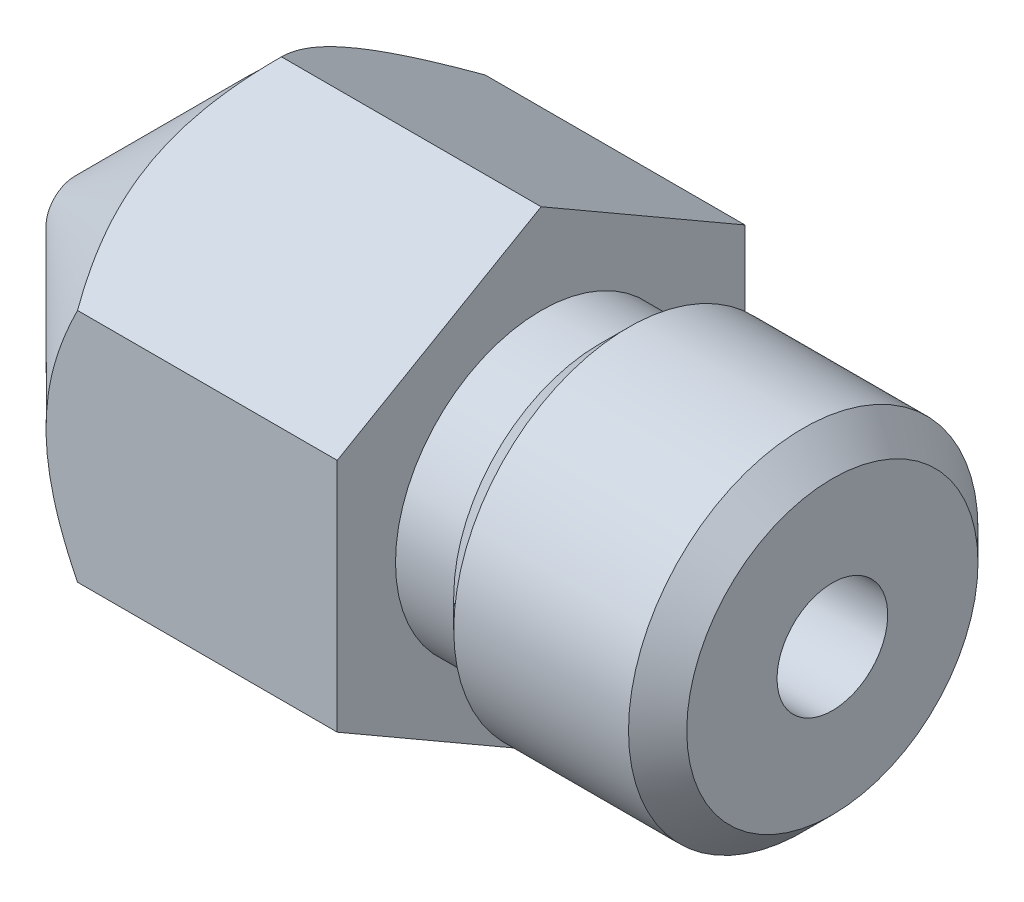
ISO-10303-21;
HEADER;
FILE_DESCRIPTION(('STEP AP214'),'2;1');
FILE_NAME('part.step','',(''),(''),'','','');
FILE_SCHEMA(('AUTOMOTIVE_DESIGN { 1 0 10303 214 1 1 1 1 }'));
ENDSEC;
DATA;
#1=APPLICATION_CONTEXT('core data for automotive mechanical design processes');
#2=APPLICATION_PROTOCOL_DEFINITION('international standard','automotive_design',2000,#1);
#3=PRODUCT_CONTEXT('',#1,'mechanical');
#4=PRODUCT('Part','Part','',(#3));
#5=PRODUCT_RELATED_PRODUCT_CATEGORY('part','',(#4));
#6=PRODUCT_DEFINITION_FORMATION('','',#4);
#7=PRODUCT_DEFINITION_CONTEXT('part definition',#1,'design');
#8=PRODUCT_DEFINITION('design','',#6,#7);
#9=PRODUCT_DEFINITION_SHAPE('','',#8);
#10=(LENGTH_UNIT() NAMED_UNIT(*) SI_UNIT(.MILLI.,.METRE.));
#11=(NAMED_UNIT(*) PLANE_ANGLE_UNIT() SI_UNIT($,.RADIAN.));
#12=(NAMED_UNIT(*) SI_UNIT($,.STERADIAN.) SOLID_ANGLE_UNIT());
#13=UNCERTAINTY_MEASURE_WITH_UNIT(LENGTH_MEASURE(1.E-05),#10,'distance_accuracy_value','');
#14=(GEOMETRIC_REPRESENTATION_CONTEXT(3) GLOBAL_UNCERTAINTY_ASSIGNED_CONTEXT((#13)) GLOBAL_UNIT_ASSIGNED_CONTEXT((#10,
#11,#12)) REPRESENTATION_CONTEXT('',''));
#15=CARTESIAN_POINT('',(0.,0.,0.));
#16=DIRECTION('',(0.,0.,1.));
#17=DIRECTION('',(1.,0.,0.));
#18=AXIS2_PLACEMENT_3D('',#15,#16,#17);
#19=CARTESIAN_POINT('',(8.,2.5,0.));
#20=DIRECTION('',(-1.,0.,0.));
#21=DIRECTION('',(0.,0.,1.));
#22=AXIS2_PLACEMENT_3D('',#19,#20,#21);
#23=PLANE('',#22);
#24=CARTESIAN_POINT('',(8.,0.,0.));
#25=DIRECTION('',(-1.,0.,0.));
#26=DIRECTION('',(0.,0.,1.));
#27=AXIS2_PLACEMENT_3D('',#24,#25,#26);
#28=CIRCLE('',#27,2.5);
#29=CARTESIAN_POINT('',(8.,0.,2.5));
#30=VERTEX_POINT('',#29);
#31=EDGE_CURVE('E154',#30,#30,#28,.T.);
#32=ORIENTED_EDGE('',*,*,#31,.T.);
#33=EDGE_LOOP('',(#32));
#34=FACE_BOUND('',#33,.T.);
#35=DIRECTION('',(0.,-1.,0.));
#36=VECTOR('',#35,1.);
#37=CARTESIAN_POINT('',(8.,2.02072594216369,3.5));
#38=LINE('',#37,#36);
#39=CARTESIAN_POINT('',(8.,2.02072594216369,3.5));
#40=VERTEX_POINT('',#39);
#41=CARTESIAN_POINT('',(8.,-2.02072594216369,3.5));
#42=VERTEX_POINT('',#41);
#43=EDGE_CURVE('E124',#40,#42,#38,.T.);
#44=ORIENTED_EDGE('',*,*,#43,.T.);
#45=DIRECTION('',(0.,-0.5,-0.866025403784439));
#46=VECTOR('',#45,1.);
#47=CARTESIAN_POINT('',(8.,-2.02072594216369,3.5));
#48=LINE('',#47,#46);
#49=CARTESIAN_POINT('',(8.,-4.04145188432738,0.));
#50=VERTEX_POINT('',#49);
#51=EDGE_CURVE('E119',#42,#50,#48,.T.);
#52=ORIENTED_EDGE('',*,*,#51,.T.);
#53=DIRECTION('',(0.,0.5,-0.866025403784439));
#54=VECTOR('',#53,1.);
#55=CARTESIAN_POINT('',(8.,-4.04145188432738,0.));
#56=LINE('',#55,#54);
#57=CARTESIAN_POINT('',(8.,-2.02072594216369,-3.5));
#58=VERTEX_POINT('',#57);
#59=EDGE_CURVE('E59',#50,#58,#56,.T.);
#60=ORIENTED_EDGE('',*,*,#59,.T.);
#61=DIRECTION('',(0.,1.,0.));
#62=VECTOR('',#61,1.);
#63=CARTESIAN_POINT('',(8.,-2.02072594216369,-3.5));
#64=LINE('',#63,#62);
#65=CARTESIAN_POINT('',(8.,2.02072594216369,-3.5));
#66=VERTEX_POINT('',#65);
#67=EDGE_CURVE('E108',#58,#66,#64,.T.);
#68=ORIENTED_EDGE('',*,*,#67,.T.);
#69=DIRECTION('',(0.,0.5,0.866025403784439));
#70=VECTOR('',#69,1.);
#71=CARTESIAN_POINT('',(8.,2.02072594216369,-3.5));
#72=LINE('',#71,#70);
#73=CARTESIAN_POINT('',(8.,4.04145188432738,0.));
#74=VERTEX_POINT('',#73);
#75=EDGE_CURVE('E115',#66,#74,#72,.T.);
#76=ORIENTED_EDGE('',*,*,#75,.T.);
#77=DIRECTION('',(0.,-0.5,0.866025403784439));
#78=VECTOR('',#77,1.);
#79=CARTESIAN_POINT('',(8.,4.04145188432738,0.));
#80=LINE('',#79,#78);
#81=EDGE_CURVE('E130',#74,#40,#80,.T.);
#82=ORIENTED_EDGE('',*,*,#81,.T.);
#83=EDGE_LOOP('',(#44,#52,#60,#68,#76,#82));
#84=FACE_BOUND('',#83,.T.);
#85=ADVANCED_FACE('F43',(#34,#84),#23,.F.);
#86=CARTESIAN_POINT('',(4.,0.,0.));
#87=DIRECTION('',(1.,0.,0.));
#88=DIRECTION('',(0.,0.,-1.));
#89=AXIS2_PLACEMENT_3D('',#86,#87,#88);
#90=CONICAL_SURFACE('',#89,4.5,0.78539816339745);
#91=CARTESIAN_POINT('',(0.,0.,0.));
#92=DIRECTION('',(-1.,0.,0.));
#93=DIRECTION('',(0.,0.,1.));
#94=AXIS2_PLACEMENT_3D('',#91,#92,#93);
#95=CIRCLE('',#94,0.499999999999984);
#96=CARTESIAN_POINT('',(0.,0.,0.499999999999984));
#97=VERTEX_POINT('',#96);
#98=EDGE_CURVE('E150',#97,#97,#95,.T.);
#99=ORIENTED_EDGE('',*,*,#98,.F.);
#100=EDGE_LOOP('',(#99));
#101=FACE_BOUND('',#100,.T.);
#102=CARTESIAN_POINT('',(5.60473460571073,-5.00177814443646,3.5));
#103=CARTESIAN_POINT('',(5.50158525305018,-4.87585100221837,3.5));
#104=CARTESIAN_POINT('',(5.39916732462682,-4.74931512243237,3.5));
#105=CARTESIAN_POINT('',(5.19618183428807,-4.49471658352455,3.5));
#106=CARTESIAN_POINT('',(5.09561475080956,-4.36665354335295,3.5));
#107=CARTESIAN_POINT('',(4.8956806099685,-4.1073404488107,3.5));
#108=CARTESIAN_POINT('',(4.79633882689846,-3.97607084326665,3.5));
#109=CARTESIAN_POINT('',(4.60061166670264,-3.71135912834578,3.5));
#110=CARTESIAN_POINT('',(4.50422600560764,-3.57791722953954,3.5));
#111=CARTESIAN_POINT('',(4.30644876507746,-3.29590423287125,3.5));
#112=CARTESIAN_POINT('',(4.20542063931455,-3.14707678989524,3.5));
#113=CARTESIAN_POINT('',(4.0092782092562,-2.84547482694549,3.5));
#114=CARTESIAN_POINT('',(3.91416582545941,-2.69269904772549,3.5));
#115=CARTESIAN_POINT('',(3.73242858701602,-2.38308612845867,3.5));
#116=CARTESIAN_POINT('',(3.64576650922454,-2.22627104221582,3.5));
#117=CARTESIAN_POINT('',(3.48347840457084,-1.90708387824138,3.5));
#118=CARTESIAN_POINT('',(3.4078428797255,-1.74471673355065,3.5));
#119=CARTESIAN_POINT('',(3.29115360790501,-1.46096984620552,3.5));
#120=CARTESIAN_POINT('',(3.24639235010286,-1.34112588832474,3.5));
#121=CARTESIAN_POINT('',(3.16645824704642,-1.09820885957048,3.5));
#122=CARTESIAN_POINT('',(3.13128671673046,-0.975135348396179,3.5));
#123=CARTESIAN_POINT('',(3.07315329237583,-0.728966718302567,3.5));
#124=CARTESIAN_POINT('',(3.04993834404319,-0.605932392197103,3.5));
#125=CARTESIAN_POINT('',(3.01613662323999,-0.358129563749721,3.5));
#126=CARTESIAN_POINT('',(3.00554687121748,-0.233361477610497,3.5));
#127=CARTESIAN_POINT('',(2.9980076393283,0.0101654253989616,3.5));
#128=CARTESIAN_POINT('',(3.0003849263801,0.128903431666411,3.5));
#129=CARTESIAN_POINT('',(3.01705527222058,0.365532552222858,3.5));
#130=CARTESIAN_POINT('',(3.03134918273084,0.483423605369748,3.5));
#131=CARTESIAN_POINT('',(3.07126805871322,0.719563148573866,3.5));
#132=CARTESIAN_POINT('',(3.09710502038985,0.83777515440585,3.5));
#133=CARTESIAN_POINT('',(3.15862164673052,1.07156228973921,3.5));
#134=CARTESIAN_POINT('',(3.19430109896366,1.1871374760929,3.5));
#135=CARTESIAN_POINT('',(3.27495249430218,1.41857905527411,3.5));
#136=CARTESIAN_POINT('',(3.32015561728366,1.53436386685402,3.5));
#137=CARTESIAN_POINT('',(3.41756542323519,1.7629573042304,3.5));
#138=CARTESIAN_POINT('',(3.46977427633029,1.87576499481178,3.5));
#139=CARTESIAN_POINT('',(3.57996695790531,2.09894682323399,3.5));
#140=CARTESIAN_POINT('',(3.63796861954407,2.20931208353451,3.5));
#141=CARTESIAN_POINT('',(3.75847190730103,2.42752018879847,3.5));
#142=CARTESIAN_POINT('',(3.82097285702742,2.53536340969175,3.5));
#143=CARTESIAN_POINT('',(3.94642001487544,2.74357548029041,3.5));
#144=CARTESIAN_POINT('',(4.00919138032335,2.8440502327273,3.5));
#145=CARTESIAN_POINT('',(4.13742428325754,3.04327327614903,3.5));
#146=CARTESIAN_POINT('',(4.20288602031573,3.14202143827798,3.5));
#147=CARTESIAN_POINT('',(4.33549374104825,3.33722918559784,3.5));
#148=CARTESIAN_POINT('',(4.40262218906713,3.43370072609763,3.5));
#149=CARTESIAN_POINT('',(4.53869269345195,3.62531773450166,3.5));
#150=CARTESIAN_POINT('',(4.60763424496689,3.72046356049015,3.5));
#151=CARTESIAN_POINT('',(4.67731849112517,3.81505265475415,3.5));
#152=B_SPLINE_CURVE_WITH_KNOTS('',3,(#102,#103,#104,#105,#106,#107,#108,#109,#110,#111,#112,
#113,#114,#115,#116,#117,#118,#119,#120,#121,#122,#123,#124,#125,#126,#127,#128,#129,#130,#131,
#132,#133,#134,#135,#136,#137,#138,#139,#140,#141,#142,#143,#144,#145,#146,#147,#148,#149,#150,
#151),.UNSPECIFIED.,.F.,.F.,(4,2,2,2,2,2,2,2,2,2,2,2,2,2,2,2,2,2,2,2,2,2,2,2,4),(0.,
0.488349249027166,0.976823010095185,1.47065642848088,1.96444225899961,2.50397255703355,
3.04367710477862,3.58088531780657,4.11762802448125,4.50109851017833,4.88462155073114,
5.25965435197999,5.63459862778907,5.99026775687149,6.34596230901475,6.70847660551895,
7.07098307847279,7.44358822460948,7.81630905811278,8.19021491747463,8.56406468333309,
8.91942809068196,9.27481790665746,9.62738125871665,9.97984745921805),.UNSPECIFIED.);
#153=CARTESIAN_POINT('',(3.54145188432738,2.02072594216369,3.5));
#154=VERTEX_POINT('',#153);
#155=CARTESIAN_POINT('',(3.54145188432738,-2.02072594216369,3.5));
#156=VERTEX_POINT('',#155);
#157=EDGE_CURVE('E207',#154,#156,#152,.F.);
#158=ORIENTED_EDGE('',*,*,#157,.F.);
#159=CARTESIAN_POINT('',(3.5415673593298,4.04156735438122,-0.000199999999999954));
#160=CARTESIAN_POINT('',(3.47216781805871,3.9721070606697,0.120108757817009));
#161=CARTESIAN_POINT('',(3.40684436318291,3.90148531215405,0.24242921436546));
#162=CARTESIAN_POINT('',(3.28723893601392,3.75747991147153,0.491853884911907));
#163=CARTESIAN_POINT('',(3.23302350720678,3.68408256574985,0.618981816842553));
#164=CARTESIAN_POINT('',(3.14015155956122,3.53608035685404,0.875329162282526));
#165=CARTESIAN_POINT('',(3.1012616245349,3.46151318117029,1.00448329914368));
#166=CARTESIAN_POINT('',(3.04134378872047,3.310737295381,1.26563479388695));
#167=CARTESIAN_POINT('',(3.02027116467501,3.2345331906662,1.39762417499828));
#168=CARTESIAN_POINT('',(3.00125799897574,3.10319782183117,1.62510370665135));
#169=CARTESIAN_POINT('',(2.99844358418733,3.04823615399913,1.72030010780516));
#170=CARTESIAN_POINT('',(3.00318657176733,2.93840222621347,1.91053805112478));
#171=CARTESIAN_POINT('',(3.0107476100844,2.88353000435281,2.00557952731163));
#172=CARTESIAN_POINT('',(3.03580978058179,2.77430542200351,2.1947620533761));
#173=CARTESIAN_POINT('',(3.0533220307075,2.71995371223668,2.2889019761705));
#174=CARTESIAN_POINT('',(3.09733078172171,2.61218376551827,2.47556499941577));
#175=CARTESIAN_POINT('',(3.12382659379173,2.55876545732784,2.56808822325597));
#176=CARTESIAN_POINT('',(3.17833985376172,2.46393368006795,2.73234167964216));
#177=CARTESIAN_POINT('',(3.20492418817716,2.42231028209655,2.80443551971228));
#178=CARTESIAN_POINT('',(3.26237725929072,2.33981072759411,2.9473289397123));
#179=CARTESIAN_POINT('',(3.29324612649086,2.29893459386684,3.01812848014492));
#180=CARTESIAN_POINT('',(3.35857622497152,2.21805834837751,3.15821024645785));
#181=CARTESIAN_POINT('',(3.39302615997836,2.17805593632086,3.22749645656528));
#182=CARTESIAN_POINT('',(3.46506598404272,2.09879193666161,3.36478573118621));
#183=CARTESIAN_POINT('',(3.50265394638793,2.05952991236255,3.43278955208019));
#184=CARTESIAN_POINT('',(3.5415673593298,2.02061047210985,3.5002));
#185=B_SPLINE_CURVE_WITH_KNOTS('',3,(#159,#160,#161,#162,#163,#164,#165,#166,#167,#168,#169,
#170,#171,#172,#173,#174,#175,#176,#177,#178,#179,#180,#181,#182,#183,#184),.UNSPECIFIED.,.F.,
.F.,(4,2,2,2,2,2,2,2,2,2,2,2,4),(0.,0.466195029511835,0.935106055247667,1.3965703522971,
1.85687285909025,2.18628459516077,2.51581179896772,2.845707891424,3.17557869467338,
3.43762138891189,3.69967206642681,3.96091985737577,4.22200840855896),.UNSPECIFIED.);
#186=CARTESIAN_POINT('',(3.54145188432739,4.04145188432738,0.));
#187=VERTEX_POINT('',#186);
#188=EDGE_CURVE('E216',#187,#154,#185,.T.);
#189=ORIENTED_EDGE('',*,*,#188,.F.);
#190=CARTESIAN_POINT('',(3.5415673593298,2.02061047210985,-3.5002));
#191=CARTESIAN_POINT('',(3.47216781805871,2.09007076582137,-3.37989124218299));
#192=CARTESIAN_POINT('',(3.40684436318291,2.16069251433702,-3.25757078563454));
#193=CARTESIAN_POINT('',(3.28723893601392,2.30469791501955,-3.0081461150881));
#194=CARTESIAN_POINT('',(3.23302350720678,2.37809526074122,-2.88101818315745));
#195=CARTESIAN_POINT('',(3.14015155956122,2.52609746963704,-2.62467083771748));
#196=CARTESIAN_POINT('',(3.1012616245349,2.60066464532078,-2.49551670085632));
#197=CARTESIAN_POINT('',(3.04134378872047,2.75144053111008,-2.23436520611305));
#198=CARTESIAN_POINT('',(3.02027116467501,2.82764463582488,-2.10237582500172));
#199=CARTESIAN_POINT('',(3.00125799897574,2.9589800046599,-1.87489629334866));
#200=CARTESIAN_POINT('',(2.99844358418733,3.01394167249194,-1.77969989219485));
#201=CARTESIAN_POINT('',(3.00318657176733,3.12377560027761,-1.58946194887522));
#202=CARTESIAN_POINT('',(3.0107476100844,3.17864782213826,-1.49442047268838));
#203=CARTESIAN_POINT('',(3.03580978058179,3.28787240448756,-1.3052379466239));
#204=CARTESIAN_POINT('',(3.0533220307075,3.34222411425439,-1.2110980238295));
#205=CARTESIAN_POINT('',(3.09733078172171,3.4499940609728,-1.02443500058423));
#206=CARTESIAN_POINT('',(3.12382659379173,3.50341236916323,-0.931911776744036));
#207=CARTESIAN_POINT('',(3.17833985376172,3.59824414642313,-0.767658320357845));
#208=CARTESIAN_POINT('',(3.20492418817716,3.63986754439453,-0.69556448028772));
#209=CARTESIAN_POINT('',(3.26237725929072,3.72236709889696,-0.552671060287704));
#210=CARTESIAN_POINT('',(3.29324612649086,3.76324323262424,-0.481871519855082));
#211=CARTESIAN_POINT('',(3.35857622497152,3.84411947811356,-0.341789753542154));
#212=CARTESIAN_POINT('',(3.39302615997836,3.88412189017022,-0.272503543434724));
#213=CARTESIAN_POINT('',(3.46506598404272,3.96338588982946,-0.135214268813787));
#214=CARTESIAN_POINT('',(3.50265394638793,4.00264791412852,-0.0672104479198107));
#215=CARTESIAN_POINT('',(3.5415673593298,4.04156735438122,0.00020000000000017));
#216=B_SPLINE_CURVE_WITH_KNOTS('',3,(#190,#191,#192,#193,#194,#195,#196,#197,#198,#199,#200,
#201,#202,#203,#204,#205,#206,#207,#208,#209,#210,#211,#212,#213,#214,#215),.UNSPECIFIED.,.F.,
.F.,(4,2,2,2,2,2,2,2,2,2,2,2,4),(0.,0.466195029511835,0.935106055247667,1.3965703522971,
1.85687285909025,2.18628459516076,2.51581179896771,2.845707891424,3.17557869467337,
3.43762138891189,3.69967206642681,3.96091985737577,4.22200840855896),.UNSPECIFIED.);
#217=CARTESIAN_POINT('',(3.54145188432739,2.02072594216369,-3.5));
#218=VERTEX_POINT('',#217);
#219=EDGE_CURVE('E288',#218,#187,#216,.T.);
#220=ORIENTED_EDGE('',*,*,#219,.F.);
#221=CARTESIAN_POINT('',(5.60473460571074,-5.00177814443646,-3.5));
#222=CARTESIAN_POINT('',(5.50158525305018,-4.87585100221837,-3.5));
#223=CARTESIAN_POINT('',(5.39916732462683,-4.74931512243238,-3.5));
#224=CARTESIAN_POINT('',(5.19618183428808,-4.49471658352455,-3.5));
#225=CARTESIAN_POINT('',(5.09561475080957,-4.36665354335295,-3.5));
#226=CARTESIAN_POINT('',(4.8956806099685,-4.1073404488107,-3.5));
#227=CARTESIAN_POINT('',(4.79633882689846,-3.97607084326666,-3.5));
#228=CARTESIAN_POINT('',(4.60061166670265,-3.71135912834578,-3.5));
#229=CARTESIAN_POINT('',(4.50422600560765,-3.57791722953954,-3.5));
#230=CARTESIAN_POINT('',(4.30644876507746,-3.29590423287125,-3.5));
#231=CARTESIAN_POINT('',(4.20542063931455,-3.14707678989524,-3.5));
#232=CARTESIAN_POINT('',(4.00927820925621,-2.84547482694549,-3.5));
#233=CARTESIAN_POINT('',(3.91416582545942,-2.69269904772549,-3.5));
#234=CARTESIAN_POINT('',(3.73242858701603,-2.38308612845867,-3.5));
#235=CARTESIAN_POINT('',(3.64576650922454,-2.22627104221582,-3.5));
#236=CARTESIAN_POINT('',(3.48347840457084,-1.90708387824137,-3.5));
#237=CARTESIAN_POINT('',(3.4078428797255,-1.74471673355065,-3.5));
#238=CARTESIAN_POINT('',(3.29115360790502,-1.46096984620551,-3.5));
#239=CARTESIAN_POINT('',(3.24639235010286,-1.34112588832474,-3.5));
#240=CARTESIAN_POINT('',(3.16645824704642,-1.09820885957048,-3.5));
#241=CARTESIAN_POINT('',(3.13128671673046,-0.975135348396178,-3.5));
#242=CARTESIAN_POINT('',(3.07315329237583,-0.728966718302567,-3.5));
#243=CARTESIAN_POINT('',(3.04993834404319,-0.605932392197102,-3.5));
#244=CARTESIAN_POINT('',(3.01613662324,-0.358129563749721,-3.5));
#245=CARTESIAN_POINT('',(3.00554687121749,-0.233361477610496,-3.5));
#246=CARTESIAN_POINT('',(2.9980076393283,0.0101654253989624,-3.5));
#247=CARTESIAN_POINT('',(3.0003849263801,0.128903431666412,-3.5));
#248=CARTESIAN_POINT('',(3.01705527222059,0.365532552222859,-3.5));
#249=CARTESIAN_POINT('',(3.03134918273085,0.48342360536975,-3.5));
#250=CARTESIAN_POINT('',(3.07126805871322,0.719563148573868,-3.5));
#251=CARTESIAN_POINT('',(3.09710502038985,0.837775154405851,-3.5));
#252=CARTESIAN_POINT('',(3.15862164673053,1.07156228973921,-3.5));
#253=CARTESIAN_POINT('',(3.19430109896366,1.1871374760929,-3.5));
#254=CARTESIAN_POINT('',(3.27495249430218,1.41857905527411,-3.5));
#255=CARTESIAN_POINT('',(3.32015561728366,1.53436386685402,-3.5));
#256=CARTESIAN_POINT('',(3.41756542323519,1.76295730423041,-3.5));
#257=CARTESIAN_POINT('',(3.4697742763303,1.87576499481178,-3.5));
#258=CARTESIAN_POINT('',(3.57996695790532,2.09894682323399,-3.5));
#259=CARTESIAN_POINT('',(3.63796861954407,2.20931208353452,-3.5));
#260=CARTESIAN_POINT('',(3.75847190730104,2.42752018879848,-3.5));
#261=CARTESIAN_POINT('',(3.82097285702742,2.53536340969176,-3.5));
#262=CARTESIAN_POINT('',(3.94642001487544,2.74357548029041,-3.5));
#263=CARTESIAN_POINT('',(4.00919138032335,2.84405023272731,-3.5));
#264=CARTESIAN_POINT('',(4.13742428325754,3.04327327614903,-3.5));
#265=CARTESIAN_POINT('',(4.20288602031574,3.14202143827798,-3.5));
#266=CARTESIAN_POINT('',(4.33549374104825,3.33722918559784,-3.5));
#267=CARTESIAN_POINT('',(4.40262218906713,3.43370072609764,-3.5));
#268=CARTESIAN_POINT('',(4.53869269345195,3.62531773450166,-3.5));
#269=CARTESIAN_POINT('',(4.6076342449669,3.72046356049016,-3.5));
#270=CARTESIAN_POINT('',(4.67731849112518,3.81505265475415,-3.5));
#271=B_SPLINE_CURVE_WITH_KNOTS('',3,(#221,#222,#223,#224,#225,#226,#227,#228,#229,#230,#231,
#232,#233,#234,#235,#236,#237,#238,#239,#240,#241,#242,#243,#244,#245,#246,#247,#248,#249,#250,
#251,#252,#253,#254,#255,#256,#257,#258,#259,#260,#261,#262,#263,#264,#265,#266,#267,#268,#269,
#270),.UNSPECIFIED.,.F.,.F.,(4,2,2,2,2,2,2,2,2,2,2,2,2,2,2,2,2,2,2,2,2,2,2,2,4),(0.,
0.488349249027167,0.976823010095186,1.47065642848089,1.96444225899962,2.50397255703356,
3.04367710477862,3.58088531780658,4.11762802448125,4.50109851017834,4.88462155073114,
5.25965435197999,5.63459862778907,5.99026775687149,6.34596230901476,6.70847660551895,
7.0709830784728,7.44358822460949,7.81630905811279,8.19021491747464,8.56406468333311,
8.91942809068197,9.27481790665748,9.62738125871667,9.97984745921806),.UNSPECIFIED.);
#272=CARTESIAN_POINT('',(3.54145188432739,-2.02072594216369,-3.5));
#273=VERTEX_POINT('',#272);
#274=EDGE_CURVE('E291',#273,#218,#271,.T.);
#275=ORIENTED_EDGE('',*,*,#274,.F.);
#276=CARTESIAN_POINT('',(3.5415673593298,-4.04156735438122,0.000199999999996348));
#277=CARTESIAN_POINT('',(3.47216781805871,-3.9721070606697,-0.120108757817013));
#278=CARTESIAN_POINT('',(3.40684436318291,-3.90148531215405,-0.242429214365463));
#279=CARTESIAN_POINT('',(3.28723893601391,-3.75747991147153,-0.491853884911911));
#280=CARTESIAN_POINT('',(3.23302350720678,-3.68408256574985,-0.618981816842557));
#281=CARTESIAN_POINT('',(3.14015155956122,-3.53608035685404,-0.87532916228253));
#282=CARTESIAN_POINT('',(3.10126162453491,-3.46151318117029,-1.00448329914369));
#283=CARTESIAN_POINT('',(3.04134378872047,-3.310737295381,-1.26563479388695));
#284=CARTESIAN_POINT('',(3.02027116467501,-3.2345331906662,-1.39762417499828));
#285=CARTESIAN_POINT('',(3.00125799897574,-3.10319782183117,-1.62510370665135));
#286=CARTESIAN_POINT('',(2.99844358418733,-3.04823615399913,-1.72030010780516));
#287=CARTESIAN_POINT('',(3.00318657176733,-2.93840222621347,-1.91053805112479));
#288=CARTESIAN_POINT('',(3.0107476100844,-2.88353000435281,-2.00557952731163));
#289=CARTESIAN_POINT('',(3.03580978058179,-2.77430542200351,-2.1947620533761));
#290=CARTESIAN_POINT('',(3.0533220307075,-2.71995371223668,-2.2889019761705));
#291=CARTESIAN_POINT('',(3.09733078172171,-2.61218376551827,-2.47556499941577));
#292=CARTESIAN_POINT('',(3.12382659379174,-2.55876545732784,-2.56808822325597));
#293=CARTESIAN_POINT('',(3.17833985376172,-2.46393368006795,-2.73234167964216));
#294=CARTESIAN_POINT('',(3.20492418817716,-2.42231028209655,-2.80443551971228));
#295=CARTESIAN_POINT('',(3.26237725929072,-2.33981072759411,-2.9473289397123));
#296=CARTESIAN_POINT('',(3.29324612649086,-2.29893459386684,-3.01812848014492));
#297=CARTESIAN_POINT('',(3.35857622497152,-2.21805834837751,-3.15821024645785));
#298=CARTESIAN_POINT('',(3.39302615997836,-2.17805593632086,-3.22749645656528));
#299=CARTESIAN_POINT('',(3.46506598404272,-2.09879193666161,-3.36478573118622));
#300=CARTESIAN_POINT('',(3.50265394638794,-2.05952991236255,-3.43278955208019));
#301=CARTESIAN_POINT('',(3.5415673593298,-2.02061047210985,-3.5002));
#302=B_SPLINE_CURVE_WITH_KNOTS('',3,(#276,#277,#278,#279,#280,#281,#282,#283,#284,#285,#286,
#287,#288,#289,#290,#291,#292,#293,#294,#295,#296,#297,#298,#299,#300,#301),.UNSPECIFIED.,.F.,
.F.,(4,2,2,2,2,2,2,2,2,2,2,2,4),(0.,0.466195029511834,0.935106055247666,1.3965703522971,
1.85687285909025,2.18628459516076,2.51581179896771,2.845707891424,3.17557869467337,
3.43762138891189,3.69967206642681,3.96091985737577,4.22200840855895),.UNSPECIFIED.);
#303=CARTESIAN_POINT('',(3.54145188432738,-4.04145188432738,0.));
#304=VERTEX_POINT('',#303);
#305=EDGE_CURVE('E100',#304,#273,#302,.T.);
#306=ORIENTED_EDGE('',*,*,#305,.F.);
#307=CARTESIAN_POINT('',(3.5415673593298,-2.02061047210985,3.5002));
#308=CARTESIAN_POINT('',(3.47216781805871,-2.09007076582137,3.37989124218299));
#309=CARTESIAN_POINT('',(3.40684436318291,-2.16069251433702,3.25757078563454));
#310=CARTESIAN_POINT('',(3.28723893601391,-2.30469791501954,3.00814611508809));
#311=CARTESIAN_POINT('',(3.23302350720678,-2.37809526074122,2.88101818315745));
#312=CARTESIAN_POINT('',(3.14015155956122,-2.52609746963704,2.62467083771747));
#313=CARTESIAN_POINT('',(3.1012616245349,-2.60066464532078,2.49551670085632));
#314=CARTESIAN_POINT('',(3.04134378872046,-2.75144053111008,2.23436520611305));
#315=CARTESIAN_POINT('',(3.02027116467501,-2.82764463582488,2.10237582500172));
#316=CARTESIAN_POINT('',(3.00125799897574,-2.9589800046599,1.87489629334865));
#317=CARTESIAN_POINT('',(2.99844358418733,-3.01394167249194,1.77969989219484));
#318=CARTESIAN_POINT('',(3.00318657176733,-3.12377560027761,1.58946194887522));
#319=CARTESIAN_POINT('',(3.0107476100844,-3.17864782213826,1.49442047268837));
#320=CARTESIAN_POINT('',(3.03580978058179,-3.28787240448756,1.3052379466239));
#321=CARTESIAN_POINT('',(3.05332203070749,-3.34222411425439,1.2110980238295));
#322=CARTESIAN_POINT('',(3.09733078172171,-3.4499940609728,1.02443500058423));
#323=CARTESIAN_POINT('',(3.12382659379173,-3.50341236916323,0.931911776744033));
#324=CARTESIAN_POINT('',(3.17833985376171,-3.59824414642312,0.767658320357841));
#325=CARTESIAN_POINT('',(3.20492418817716,-3.63986754439452,0.695564480287717));
#326=CARTESIAN_POINT('',(3.26237725929072,-3.72236709889696,0.552671060287701));
#327=CARTESIAN_POINT('',(3.29324612649085,-3.76324323262424,0.481871519855078));
#328=CARTESIAN_POINT('',(3.35857622497152,-3.84411947811356,0.341789753542151));
#329=CARTESIAN_POINT('',(3.39302615997836,-3.88412189017022,0.27250354343472));
#330=CARTESIAN_POINT('',(3.46506598404272,-3.96338588982946,0.135214268813784));
#331=CARTESIAN_POINT('',(3.50265394638793,-4.00264791412852,0.0672104479198071));
#332=CARTESIAN_POINT('',(3.5415673593298,-4.04156735438122,-0.000200000000003697));
#333=B_SPLINE_CURVE_WITH_KNOTS('',3,(#307,#308,#309,#310,#311,#312,#313,#314,#315,#316,#317,
#318,#319,#320,#321,#322,#323,#324,#325,#326,#327,#328,#329,#330,#331,#332),.UNSPECIFIED.,.F.,
.F.,(4,2,2,2,2,2,2,2,2,2,2,2,4),(0.,0.466195029511835,0.935106055247667,1.3965703522971,
1.85687285909025,2.18628459516077,2.51581179896772,2.845707891424,3.17557869467338,
3.43762138891189,3.69967206642681,3.96091985737577,4.22200840855896),.UNSPECIFIED.);
#334=EDGE_CURVE('E174',#156,#304,#333,.T.);
#335=ORIENTED_EDGE('',*,*,#334,.F.);
#336=EDGE_LOOP('',(#158,#189,#220,#275,#306,#335));
#337=FACE_BOUND('',#336,.T.);
#338=ADVANCED_FACE('F189',(#101,#337),#90,.T.);
#339=CARTESIAN_POINT('',(0.,0.,0.));
#340=DIRECTION('',(-1.,0.,0.));
#341=DIRECTION('',(0.,0.,1.));
#342=AXIS2_PLACEMENT_3D('',#339,#340,#341);
#343=CYLINDRICAL_SURFACE('',#342,0.2);
#344=CARTESIAN_POINT('',(1.25,0.,0.));
#345=DIRECTION('',(-1.,0.,0.));
#346=DIRECTION('',(0.,0.,1.));
#347=AXIS2_PLACEMENT_3D('',#344,#345,#346);
#348=CIRCLE('',#347,0.2);
#349=CARTESIAN_POINT('',(1.25,0.,-0.2));
#350=VERTEX_POINT('',#349);
#351=EDGE_CURVE('E170',#350,#350,#348,.T.);
#352=ORIENTED_EDGE('',*,*,#351,.F.);
#353=EDGE_LOOP('',(#352));
#354=FACE_BOUND('',#353,.T.);
#355=CARTESIAN_POINT('',(0.,0.,0.));
#356=DIRECTION('',(-1.,0.,0.));
#357=DIRECTION('',(0.,0.,1.));
#358=AXIS2_PLACEMENT_3D('',#355,#356,#357);
#359=CIRCLE('',#358,0.2);
#360=CARTESIAN_POINT('',(0.,0.,0.2));
#361=VERTEX_POINT('',#360);
#362=EDGE_CURVE('E137',#361,#361,#359,.T.);
#363=ORIENTED_EDGE('',*,*,#362,.T.);
#364=EDGE_LOOP('',(#363));
#365=FACE_BOUND('',#364,.T.);
#366=ADVANCED_FACE('F246',(#354,#365),#343,.F.);
#367=CARTESIAN_POINT('',(1.25,0.,0.));
#368=DIRECTION('',(1.,0.,0.));
#369=DIRECTION('',(0.,0.,-1.));
#370=AXIS2_PLACEMENT_3D('',#367,#368,#369);
#371=CONICAL_SURFACE('',#370,0.2,0.78539816339745);
#372=CARTESIAN_POINT('',(2.,0.,0.));
#373=DIRECTION('',(-1.,0.,0.));
#374=DIRECTION('',(0.,0.,1.));
#375=AXIS2_PLACEMENT_3D('',#372,#373,#374);
#376=CIRCLE('',#375,0.95);
#377=CARTESIAN_POINT('',(2.,0.,-0.95));
#378=VERTEX_POINT('',#377);
#379=EDGE_CURVE('E166',#378,#378,#376,.T.);
#380=CARTESIAN_POINT('',(2.,0.,-0.95));
#381=CARTESIAN_POINT('',(1.9921875,0.,-0.9421875));
#382=CARTESIAN_POINT('',(1.984375,0.,-0.934375));
#383=CARTESIAN_POINT('',(1.96875,0.,-0.91875));
#384=CARTESIAN_POINT('',(1.9609375,0.,-0.9109375));
#385=CARTESIAN_POINT('',(1.9453125,0.,-0.8953125));
#386=CARTESIAN_POINT('',(1.9375,0.,-0.8875));
#387=CARTESIAN_POINT('',(1.921875,0.,-0.871875));
#388=CARTESIAN_POINT('',(1.9140625,0.,-0.8640625));
#389=CARTESIAN_POINT('',(1.8984375,0.,-0.8484375));
#390=CARTESIAN_POINT('',(1.890625,0.,-0.840625));
#391=CARTESIAN_POINT('',(1.875,0.,-0.825));
#392=CARTESIAN_POINT('',(1.8671875,0.,-0.8171875));
#393=CARTESIAN_POINT('',(1.8515625,0.,-0.8015625));
#394=CARTESIAN_POINT('',(1.84375,0.,-0.79375));
#395=CARTESIAN_POINT('',(1.828125,0.,-0.778125));
#396=CARTESIAN_POINT('',(1.8203125,0.,-0.7703125));
#397=CARTESIAN_POINT('',(1.8046875,0.,-0.7546875));
#398=CARTESIAN_POINT('',(1.796875,0.,-0.746875));
#399=CARTESIAN_POINT('',(1.78125,0.,-0.73125));
#400=CARTESIAN_POINT('',(1.7734375,0.,-0.7234375));
#401=CARTESIAN_POINT('',(1.7578125,0.,-0.7078125));
#402=CARTESIAN_POINT('',(1.75,0.,-0.7));
#403=CARTESIAN_POINT('',(1.734375,0.,-0.684375));
#404=CARTESIAN_POINT('',(1.7265625,0.,-0.6765625));
#405=CARTESIAN_POINT('',(1.7109375,0.,-0.6609375));
#406=CARTESIAN_POINT('',(1.703125,0.,-0.653125));
#407=CARTESIAN_POINT('',(1.6875,0.,-0.6375));
#408=CARTESIAN_POINT('',(1.6796875,0.,-0.6296875));
#409=CARTESIAN_POINT('',(1.6640625,0.,-0.6140625));
#410=CARTESIAN_POINT('',(1.65625,0.,-0.60625));
#411=CARTESIAN_POINT('',(1.640625,0.,-0.590625));
#412=CARTESIAN_POINT('',(1.6328125,0.,-0.5828125));
#413=CARTESIAN_POINT('',(1.6171875,0.,-0.5671875));
#414=CARTESIAN_POINT('',(1.609375,0.,-0.559375));
#415=CARTESIAN_POINT('',(1.59375,0.,-0.54375));
#416=CARTESIAN_POINT('',(1.5859375,0.,-0.5359375));
#417=CARTESIAN_POINT('',(1.5703125,0.,-0.5203125));
#418=CARTESIAN_POINT('',(1.5625,0.,-0.5125));
#419=CARTESIAN_POINT('',(1.546875,0.,-0.496875));
#420=CARTESIAN_POINT('',(1.5390625,0.,-0.4890625));
#421=CARTESIAN_POINT('',(1.5234375,0.,-0.4734375));
#422=CARTESIAN_POINT('',(1.515625,0.,-0.465625));
#423=CARTESIAN_POINT('',(1.5,0.,-0.45));
#424=CARTESIAN_POINT('',(1.4921875,0.,-0.4421875));
#425=CARTESIAN_POINT('',(1.4765625,0.,-0.4265625));
#426=CARTESIAN_POINT('',(1.46875,0.,-0.41875));
#427=CARTESIAN_POINT('',(1.453125,0.,-0.403125));
#428=CARTESIAN_POINT('',(1.4453125,0.,-0.3953125));
#429=CARTESIAN_POINT('',(1.4296875,0.,-0.3796875));
#430=CARTESIAN_POINT('',(1.421875,0.,-0.371875));
#431=CARTESIAN_POINT('',(1.40625,0.,-0.35625));
#432=CARTESIAN_POINT('',(1.3984375,0.,-0.3484375));
#433=CARTESIAN_POINT('',(1.3828125,0.,-0.3328125));
#434=CARTESIAN_POINT('',(1.375,0.,-0.325));
#435=CARTESIAN_POINT('',(1.359375,0.,-0.309375));
#436=CARTESIAN_POINT('',(1.3515625,0.,-0.3015625));
#437=CARTESIAN_POINT('',(1.3359375,0.,-0.2859375));
#438=CARTESIAN_POINT('',(1.328125,0.,-0.278125));
#439=CARTESIAN_POINT('',(1.3125,0.,-0.2625));
#440=CARTESIAN_POINT('',(1.3046875,0.,-0.2546875));
#441=CARTESIAN_POINT('',(1.2890625,0.,-0.2390625));
#442=CARTESIAN_POINT('',(1.28125,0.,-0.23125));
#443=CARTESIAN_POINT('',(1.265625,0.,-0.215625));
#444=CARTESIAN_POINT('',(1.2578125,0.,-0.2078125));
#445=CARTESIAN_POINT('',(1.25,0.,-0.2));
#446=B_SPLINE_CURVE_WITH_KNOTS('',3,(#380,#381,#382,#383,#384,#385,#386,#387,#388,#389,#390,
#391,#392,#393,#394,#395,#396,#397,#398,#399,#400,#401,#402,#403,#404,#405,#406,#407,#408,#409,
#410,#411,#412,#413,#414,#415,#416,#417,#418,#419,#420,#421,#422,#423,#424,#425,#426,#427,#428,
#429,#430,#431,#432,#433,#434,#435,#436,#437,#438,#439,#440,#441,#442,#443,#444,#445),
.UNSPECIFIED.,.F.,.F.,(4,2,2,2,2,2,2,2,2,2,2,2,2,2,2,2,2,2,2,2,2,2,2,2,2,2,2,2,2,2,2,2,4),(0.,
0.0331456303681191,0.0662912607362385,0.099436891104358,0.132582521472477,0.165728151840597,
0.198873782208716,0.232019412576835,0.265165042944955,0.298310673313074,0.331456303681194,
0.364601934049313,0.397747564417432,0.430893194785552,0.464038825153671,0.49718445552179,
0.53033008588991,0.563475716258029,0.596621346626149,0.629766976994268,0.662912607362387,
0.696058237730507,0.729203868098626,0.762349498466745,0.795495128834865,0.828640759202984,
0.861786389571103,0.894932019939223,0.928077650307342,0.961223280675462,0.994368911043581,
1.0275145414117,1.06066017177982),.UNSPECIFIED.);
#447=EDGE_CURVE('BSEAM262',#378,#350,#446,.T.);
#448=ORIENTED_EDGE('',*,*,#379,.F.);
#449=ORIENTED_EDGE('',*,*,#351,.T.);
#450=ORIENTED_EDGE('',*,*,#447,.T.);
#451=ORIENTED_EDGE('',*,*,#447,.F.);
#452=EDGE_LOOP('',(#448,#450,#449,#451));
#453=FACE_BOUND('',#452,.T.);
#454=ADVANCED_FACE('F262',(#453),#371,.F.);
#455=CARTESIAN_POINT('',(0.,0.,0.));
#456=DIRECTION('',(-1.,0.,0.));
#457=DIRECTION('',(0.,0.,1.));
#458=AXIS2_PLACEMENT_3D('',#455,#456,#457);
#459=CYLINDRICAL_SURFACE('',#458,0.95);
#460=CARTESIAN_POINT('',(13.,0.,0.));
#461=DIRECTION('',(-1.,0.,0.));
#462=DIRECTION('',(0.,0.,1.));
#463=AXIS2_PLACEMENT_3D('',#460,#461,#462);
#464=CIRCLE('',#463,0.95);
#465=CARTESIAN_POINT('',(13.,0.,0.95));
#466=VERTEX_POINT('',#465);
#467=EDGE_CURVE('E162',#466,#466,#464,.T.);
#468=ORIENTED_EDGE('',*,*,#467,.F.);
#469=EDGE_LOOP('',(#468));
#470=FACE_BOUND('',#469,.T.);
#471=ORIENTED_EDGE('',*,*,#379,.T.);
#472=EDGE_LOOP('',(#471));
#473=FACE_BOUND('',#472,.T.);
#474=ADVANCED_FACE('F258',(#470,#473),#459,.F.);
#475=CARTESIAN_POINT('',(13.,0.95,0.));
#476=DIRECTION('',(-1.,0.,0.));
#477=DIRECTION('',(0.,0.,1.));
#478=AXIS2_PLACEMENT_3D('',#475,#476,#477);
#479=PLANE('',#478);
#480=CARTESIAN_POINT('',(13.,0.,0.));
#481=DIRECTION('',(-1.,0.,0.));
#482=DIRECTION('',(0.,0.,1.));
#483=AXIS2_PLACEMENT_3D('',#480,#481,#482);
#484=CIRCLE('',#483,2.5);
#485=CARTESIAN_POINT('',(13.,0.,2.5));
#486=VERTEX_POINT('',#485);
#487=EDGE_CURVE('E12',#486,#486,#484,.F.);
#488=ORIENTED_EDGE('',*,*,#487,.T.);
#489=EDGE_LOOP('',(#488));
#490=FACE_BOUND('',#489,.T.);
#491=ORIENTED_EDGE('',*,*,#467,.T.);
#492=EDGE_LOOP('',(#491));
#493=FACE_BOUND('',#492,.T.);
#494=ADVANCED_FACE('F255',(#490,#493),#479,.F.);
#495=CARTESIAN_POINT('',(0.,0.,0.));
#496=DIRECTION('',(-1.,0.,0.));
#497=DIRECTION('',(0.,0.,1.));
#498=AXIS2_PLACEMENT_3D('',#495,#496,#497);
#499=CYLINDRICAL_SURFACE('',#498,3.);
#500=CARTESIAN_POINT('',(12.5,0.,0.));
#501=DIRECTION('',(-1.,0.,0.));
#502=DIRECTION('',(0.,0.,1.));
#503=AXIS2_PLACEMENT_3D('',#500,#501,#502);
#504=CIRCLE('',#503,3.);
#505=CARTESIAN_POINT('',(12.5,0.,3.));
#506=VERTEX_POINT('',#505);
#507=EDGE_CURVE('E52',#506,#506,#504,.T.);
#508=ORIENTED_EDGE('',*,*,#507,.T.);
#509=EDGE_LOOP('',(#508));
#510=FACE_BOUND('',#509,.T.);
#511=CARTESIAN_POINT('',(9.5,0.,0.));
#512=DIRECTION('',(1.,0.,0.));
#513=DIRECTION('',(0.,0.,-1.));
#514=AXIS2_PLACEMENT_3D('',#511,#512,#513);
#515=CIRCLE('',#514,3.);
#516=CARTESIAN_POINT('',(9.5,0.,-3.));
#517=VERTEX_POINT('',#516);
#518=EDGE_CURVE('E215',#517,#517,#515,.T.);
#519=ORIENTED_EDGE('',*,*,#518,.T.);
#520=EDGE_LOOP('',(#519));
#521=FACE_BOUND('',#520,.T.);
#522=ADVANCED_FACE('F230',(#510,#521),#499,.T.);
#523=CARTESIAN_POINT('',(0.,0.,0.));
#524=DIRECTION('',(-1.,0.,0.));
#525=DIRECTION('',(0.,0.,1.));
#526=AXIS2_PLACEMENT_3D('',#523,#524,#525);
#527=CYLINDRICAL_SURFACE('',#526,2.5);
#528=ORIENTED_EDGE('',*,*,#31,.F.);
#529=EDGE_LOOP('',(#528));
#530=FACE_BOUND('',#529,.T.);
#531=CARTESIAN_POINT('',(9.,0.,0.));
#532=DIRECTION('',(-1.,0.,0.));
#533=DIRECTION('',(0.,0.,1.));
#534=AXIS2_PLACEMENT_3D('',#531,#532,#533);
#535=CIRCLE('',#534,2.5);
#536=CARTESIAN_POINT('',(9.,0.,2.5));
#537=VERTEX_POINT('',#536);
#538=EDGE_CURVE('E158',#537,#537,#535,.T.);
#539=ORIENTED_EDGE('',*,*,#538,.T.);
#540=EDGE_LOOP('',(#539));
#541=FACE_BOUND('',#540,.T.);
#542=ADVANCED_FACE('F249',(#530,#541),#527,.T.);
#543=CARTESIAN_POINT('',(0.,0.499999999999984,0.));
#544=DIRECTION('',(1.,0.,0.));
#545=DIRECTION('',(0.,0.,-1.));
#546=AXIS2_PLACEMENT_3D('',#543,#544,#545);
#547=PLANE('',#546);
#548=ORIENTED_EDGE('',*,*,#362,.F.);
#549=EDGE_LOOP('',(#548));
#550=FACE_BOUND('',#549,.T.);
#551=ORIENTED_EDGE('',*,*,#98,.T.);
#552=EDGE_LOOP('',(#551));
#553=FACE_BOUND('',#552,.T.);
#554=ADVANCED_FACE('F204',(#550,#553),#547,.F.);
#555=CARTESIAN_POINT('',(-2.,2.02072594216369,3.5));
#556=DIRECTION('',(0.,0.,1.));
#557=DIRECTION('',(0.,-1.,0.));
#558=AXIS2_PLACEMENT_3D('',#555,#556,#557);
#559=PLANE('',#558);
#560=ORIENTED_EDGE('',*,*,#157,.T.);
#561=DIRECTION('',(1.,0.,0.));
#562=VECTOR('',#561,1.);
#563=CARTESIAN_POINT('',(-2.,-2.02072594216369,3.5));
#564=LINE('',#563,#562);
#565=EDGE_CURVE('E67',#156,#42,#564,.T.);
#566=ORIENTED_EDGE('',*,*,#565,.T.);
#567=ORIENTED_EDGE('',*,*,#43,.F.);
#568=DIRECTION('',(1.,0.,0.));
#569=VECTOR('',#568,1.);
#570=CARTESIAN_POINT('',(-2.,2.02072594216369,3.5));
#571=LINE('',#570,#569);
#572=EDGE_CURVE('E134',#154,#40,#571,.T.);
#573=ORIENTED_EDGE('',*,*,#572,.F.);
#574=EDGE_LOOP('',(#560,#566,#567,#573));
#575=FACE_BOUND('',#574,.T.);
#576=ADVANCED_FACE('F200',(#575),#559,.T.);
#577=CARTESIAN_POINT('',(-2.,4.04145188432738,0.));
#578=DIRECTION('',(0.,0.866025403784439,0.5));
#579=DIRECTION('',(0.,-0.5,0.866025403784439));
#580=AXIS2_PLACEMENT_3D('',#577,#578,#579);
#581=PLANE('',#580);
#582=ORIENTED_EDGE('',*,*,#188,.T.);
#583=ORIENTED_EDGE('',*,*,#572,.T.);
#584=ORIENTED_EDGE('',*,*,#81,.F.);
#585=DIRECTION('',(1.,0.,0.));
#586=VECTOR('',#585,1.);
#587=CARTESIAN_POINT('',(-2.,4.04145188432738,0.));
#588=LINE('',#587,#586);
#589=EDGE_CURVE('E138',#187,#74,#588,.T.);
#590=ORIENTED_EDGE('',*,*,#589,.F.);
#591=EDGE_LOOP('',(#582,#583,#584,#590));
#592=FACE_BOUND('',#591,.T.);
#593=ADVANCED_FACE('F203',(#592),#581,.T.);
#594=CARTESIAN_POINT('',(-2.,2.02072594216369,-3.5));
#595=DIRECTION('',(0.,0.866025403784439,-0.5));
#596=DIRECTION('',(0.,0.5,0.866025403784439));
#597=AXIS2_PLACEMENT_3D('',#594,#595,#596);
#598=PLANE('',#597);
#599=ORIENTED_EDGE('',*,*,#219,.T.);
#600=ORIENTED_EDGE('',*,*,#589,.T.);
#601=ORIENTED_EDGE('',*,*,#75,.F.);
#602=DIRECTION('',(1.,0.,0.));
#603=VECTOR('',#602,1.);
#604=CARTESIAN_POINT('',(-2.,2.02072594216369,-3.5));
#605=LINE('',#604,#603);
#606=EDGE_CURVE('E104',#218,#66,#605,.T.);
#607=ORIENTED_EDGE('',*,*,#606,.F.);
#608=EDGE_LOOP('',(#599,#600,#601,#607));
#609=FACE_BOUND('',#608,.T.);
#610=ADVANCED_FACE('F304',(#609),#598,.T.);
#611=CARTESIAN_POINT('',(-2.,-2.02072594216369,-3.5));
#612=DIRECTION('',(0.,0.,-1.));
#613=DIRECTION('',(0.,1.,0.));
#614=AXIS2_PLACEMENT_3D('',#611,#612,#613);
#615=PLANE('',#614);
#616=ORIENTED_EDGE('',*,*,#274,.T.);
#617=ORIENTED_EDGE('',*,*,#606,.T.);
#618=ORIENTED_EDGE('',*,*,#67,.F.);
#619=DIRECTION('',(1.,0.,0.));
#620=VECTOR('',#619,1.);
#621=CARTESIAN_POINT('',(-2.,-2.02072594216369,-3.5));
#622=LINE('',#621,#620);
#623=EDGE_CURVE('E96',#273,#58,#622,.T.);
#624=ORIENTED_EDGE('',*,*,#623,.F.);
#625=EDGE_LOOP('',(#616,#617,#618,#624));
#626=FACE_BOUND('',#625,.T.);
#627=ADVANCED_FACE('F109',(#626),#615,.T.);
#628=CARTESIAN_POINT('',(-2.,-4.04145188432738,0.));
#629=DIRECTION('',(0.,-0.866025403784439,-0.5));
#630=DIRECTION('',(0.,0.5,-0.866025403784439));
#631=AXIS2_PLACEMENT_3D('',#628,#629,#630);
#632=PLANE('',#631);
#633=ORIENTED_EDGE('',*,*,#305,.T.);
#634=ORIENTED_EDGE('',*,*,#623,.T.);
#635=ORIENTED_EDGE('',*,*,#59,.F.);
#636=DIRECTION('',(1.,0.,0.));
#637=VECTOR('',#636,1.);
#638=CARTESIAN_POINT('',(-2.,-4.04145188432738,0.));
#639=LINE('',#638,#637);
#640=EDGE_CURVE('E105',#304,#50,#639,.T.);
#641=ORIENTED_EDGE('',*,*,#640,.F.);
#642=EDGE_LOOP('',(#633,#634,#635,#641));
#643=FACE_BOUND('',#642,.T.);
#644=ADVANCED_FACE('F98',(#643),#632,.T.);
#645=CARTESIAN_POINT('',(-2.,-2.02072594216369,3.5));
#646=DIRECTION('',(0.,-0.866025403784439,0.5));
#647=DIRECTION('',(0.,-0.5,-0.866025403784439));
#648=AXIS2_PLACEMENT_3D('',#645,#646,#647);
#649=PLANE('',#648);
#650=ORIENTED_EDGE('',*,*,#334,.T.);
#651=ORIENTED_EDGE('',*,*,#640,.T.);
#652=ORIENTED_EDGE('',*,*,#51,.F.);
#653=ORIENTED_EDGE('',*,*,#565,.F.);
#654=EDGE_LOOP('',(#650,#651,#652,#653));
#655=FACE_BOUND('',#654,.T.);
#656=ADVANCED_FACE('F193',(#655),#649,.T.);
#657=CARTESIAN_POINT('',(12.5,0.,0.));
#658=DIRECTION('',(-1.,0.,0.));
#659=DIRECTION('',(0.,0.,1.));
#660=AXIS2_PLACEMENT_3D('',#657,#658,#659);
#661=CONICAL_SURFACE('',#660,3.,0.785398163397449);
#662=ORIENTED_EDGE('',*,*,#487,.F.);
#663=EDGE_LOOP('',(#662));
#664=FACE_BOUND('',#663,.T.);
#665=ORIENTED_EDGE('',*,*,#507,.F.);
#666=EDGE_LOOP('',(#665));
#667=FACE_BOUND('',#666,.T.);
#668=ADVANCED_FACE('F197',(#664,#667),#661,.T.);
#669=CARTESIAN_POINT('',(9.,0.,0.));
#670=DIRECTION('',(1.,0.,0.));
#671=DIRECTION('',(0.,0.,-1.));
#672=AXIS2_PLACEMENT_3D('',#669,#670,#671);
#673=CONICAL_SURFACE('',#672,2.5,0.785398163397446);
#674=ORIENTED_EDGE('',*,*,#518,.F.);
#675=EDGE_LOOP('',(#674));
#676=FACE_BOUND('',#675,.T.);
#677=ORIENTED_EDGE('',*,*,#538,.F.);
#678=EDGE_LOOP('',(#677));
#679=FACE_BOUND('',#678,.T.);
#680=ADVANCED_FACE('F45',(#676,#679),#673,.T.);
#681=CLOSED_SHELL('',(#85,#338,#366,#454,#474,#494,#522,#542,#554,#576,#593,#610,#627,#644,#656,
#668,#680));
#682=MANIFOLD_SOLID_BREP('B2',#681);
#683=ADVANCED_BREP_SHAPE_REPRESENTATION('',(#18,#682),#14);
#684=SHAPE_DEFINITION_REPRESENTATION(#9,#683);
ENDSEC;
END-ISO-10303-21;
